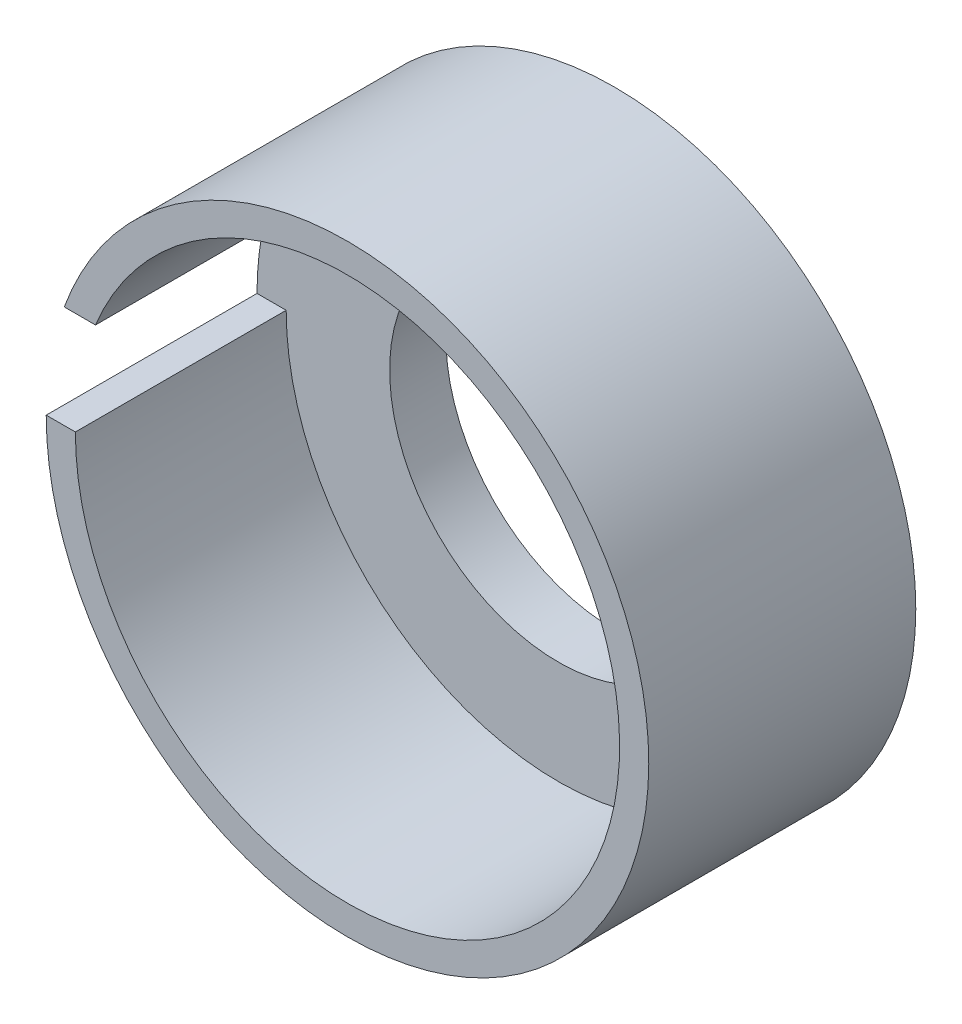
ISO-10303-21;
HEADER;
FILE_DESCRIPTION(('STEP AP214'),'2;1');
FILE_NAME('part.step','',(''),(''),'','','');
FILE_SCHEMA(('AUTOMOTIVE_DESIGN { 1 0 10303 214 1 1 1 1 }'));
ENDSEC;
DATA;
#1=APPLICATION_CONTEXT('core data for automotive mechanical design processes');
#2=APPLICATION_PROTOCOL_DEFINITION('international standard','automotive_design',2000,#1);
#3=PRODUCT_CONTEXT('',#1,'mechanical');
#4=PRODUCT('Part','Part','',(#3));
#5=PRODUCT_RELATED_PRODUCT_CATEGORY('part','',(#4));
#6=PRODUCT_DEFINITION_FORMATION('','',#4);
#7=PRODUCT_DEFINITION_CONTEXT('part definition',#1,'design');
#8=PRODUCT_DEFINITION('design','',#6,#7);
#9=PRODUCT_DEFINITION_SHAPE('','',#8);
#10=(LENGTH_UNIT() NAMED_UNIT(*) SI_UNIT(.MILLI.,.METRE.));
#11=(NAMED_UNIT(*) PLANE_ANGLE_UNIT() SI_UNIT($,.RADIAN.));
#12=(NAMED_UNIT(*) SI_UNIT($,.STERADIAN.) SOLID_ANGLE_UNIT());
#13=UNCERTAINTY_MEASURE_WITH_UNIT(LENGTH_MEASURE(1.E-05),#10,'distance_accuracy_value','');
#14=(GEOMETRIC_REPRESENTATION_CONTEXT(3) GLOBAL_UNCERTAINTY_ASSIGNED_CONTEXT((#13)) GLOBAL_UNIT_ASSIGNED_CONTEXT((#10,
#11,#12)) REPRESENTATION_CONTEXT('',''));
#15=CARTESIAN_POINT('',(0.,0.,0.));
#16=DIRECTION('',(0.,0.,1.));
#17=DIRECTION('',(1.,0.,0.));
#18=AXIS2_PLACEMENT_3D('',#15,#16,#17);
#19=CARTESIAN_POINT('',(0.,0.,8.));
#20=DIRECTION('',(0.,0.,1.));
#21=DIRECTION('',(1.,0.,0.));
#22=AXIS2_PLACEMENT_3D('',#19,#20,#21);
#23=PLANE('',#22);
#24=CARTESIAN_POINT('',(0.,0.,8.));
#25=DIRECTION('',(0.,0.,1.));
#26=DIRECTION('',(1.,0.,0.));
#27=AXIS2_PLACEMENT_3D('',#24,#25,#26);
#28=CIRCLE('',#27,24.);
#29=CARTESIAN_POINT('',(24.,0.,8.));
#30=VERTEX_POINT('',#29);
#31=EDGE_CURVE('E110',#30,#30,#28,.T.);
#32=ORIENTED_EDGE('',*,*,#31,.F.);
#33=EDGE_LOOP('',(#32));
#34=FACE_BOUND('',#33,.T.);
#35=CARTESIAN_POINT('',(0.,0.,8.));
#36=DIRECTION('',(0.,0.,1.));
#37=DIRECTION('',(1.,0.,0.));
#38=AXIS2_PLACEMENT_3D('',#35,#36,#37);
#39=CIRCLE('',#38,38.725);
#40=CARTESIAN_POINT('',(-38.725,0.,8.));
#41=VERTEX_POINT('',#40);
#42=CARTESIAN_POINT('',(-35.860803878207,14.616031274213,8.));
#43=VERTEX_POINT('',#42);
#44=EDGE_CURVE('E59',#41,#43,#39,.T.);
#45=ORIENTED_EDGE('',*,*,#44,.T.);
#46=DIRECTION('',(-1.,0.,0.));
#47=VECTOR('',#46,1.);
#48=CARTESIAN_POINT('',(2.05302480507719E-13,14.6160312742125,8.));
#49=LINE('',#48,#47);
#50=CARTESIAN_POINT('',(-40.3067891898031,14.616031274213,8.));
#51=VERTEX_POINT('',#50);
#52=EDGE_CURVE('E105',#43,#51,#49,.T.);
#53=ORIENTED_EDGE('',*,*,#52,.T.);
#54=CARTESIAN_POINT('',(0.,0.,8.));
#55=DIRECTION('',(0.,0.,1.));
#56=DIRECTION('',(1.,0.,0.));
#57=AXIS2_PLACEMENT_3D('',#54,#55,#56);
#58=CIRCLE('',#57,42.875);
#59=CARTESIAN_POINT('',(-42.875,0.,8.));
#60=VERTEX_POINT('',#59);
#61=EDGE_CURVE('E11',#51,#60,#58,.T.);
#62=ORIENTED_EDGE('',*,*,#61,.T.);
#63=DIRECTION('',(-1.,0.,0.));
#64=VECTOR('',#63,1.);
#65=CARTESIAN_POINT('',(0.,0.,8.));
#66=LINE('',#65,#64);
#67=EDGE_CURVE('E63',#41,#60,#66,.T.);
#68=ORIENTED_EDGE('',*,*,#67,.F.);
#69=EDGE_LOOP('',(#45,#53,#62,#68));
#70=FACE_BOUND('',#69,.T.);
#71=ADVANCED_FACE('F41',(#34,#70),#23,.T.);
#72=CARTESIAN_POINT('',(0.,0.,8.));
#73=DIRECTION('',(0.,0.,-1.));
#74=DIRECTION('',(-1.,0.,0.));
#75=AXIS2_PLACEMENT_3D('',#72,#73,#74);
#76=CYLINDRICAL_SURFACE('',#75,42.875);
#77=ORIENTED_EDGE('',*,*,#61,.F.);
#78=DIRECTION('',(0.,0.,-1.));
#79=VECTOR('',#78,1.);
#80=CARTESIAN_POINT('',(-40.3067891898031,14.616031274213,38.));
#81=LINE('',#80,#79);
#82=CARTESIAN_POINT('',(-40.3067891898031,14.616031274213,38.));
#83=VERTEX_POINT('',#82);
#84=EDGE_CURVE('E123',#83,#51,#81,.T.);
#85=ORIENTED_EDGE('',*,*,#84,.F.);
#86=CARTESIAN_POINT('',(0.,0.,38.));
#87=DIRECTION('',(0.,0.,1.));
#88=DIRECTION('',(1.,0.,0.));
#89=AXIS2_PLACEMENT_3D('',#86,#87,#88);
#90=CIRCLE('',#89,42.875);
#91=CARTESIAN_POINT('',(-42.875,0.,38.));
#92=VERTEX_POINT('',#91);
#93=EDGE_CURVE('E99',#92,#83,#90,.T.);
#94=ORIENTED_EDGE('',*,*,#93,.F.);
#95=DIRECTION('',(0.,0.,-1.));
#96=VECTOR('',#95,1.);
#97=CARTESIAN_POINT('',(-42.875,0.,38.));
#98=LINE('',#97,#96);
#99=EDGE_CURVE('E90',#92,#60,#98,.T.);
#100=ORIENTED_EDGE('',*,*,#99,.T.);
#101=EDGE_LOOP('',(#77,#85,#94,#100));
#102=FACE_BOUND('',#101,.T.);
#103=CARTESIAN_POINT('',(0.,0.,0.));
#104=DIRECTION('',(0.,0.,1.));
#105=DIRECTION('',(1.,0.,0.));
#106=AXIS2_PLACEMENT_3D('',#103,#104,#105);
#107=CIRCLE('',#106,42.875);
#108=CARTESIAN_POINT('',(42.875,0.,0.));
#109=VERTEX_POINT('',#108);
#110=EDGE_CURVE('E51',#109,#109,#107,.T.);
#111=ORIENTED_EDGE('',*,*,#110,.T.);
#112=EDGE_LOOP('',(#111));
#113=FACE_BOUND('',#112,.T.);
#114=ADVANCED_FACE('F43',(#102,#113),#76,.T.);
#115=CARTESIAN_POINT('',(0.,0.,0.));
#116=DIRECTION('',(0.,0.,1.));
#117=DIRECTION('',(1.,0.,0.));
#118=AXIS2_PLACEMENT_3D('',#115,#116,#117);
#119=PLANE('',#118);
#120=CARTESIAN_POINT('',(0.,0.,0.));
#121=DIRECTION('',(0.,0.,1.));
#122=DIRECTION('',(1.,0.,0.));
#123=AXIS2_PLACEMENT_3D('',#120,#121,#122);
#124=CIRCLE('',#123,24.);
#125=CARTESIAN_POINT('',(24.,0.,0.));
#126=VERTEX_POINT('',#125);
#127=EDGE_CURVE('E45',#126,#126,#124,.T.);
#128=ORIENTED_EDGE('',*,*,#127,.T.);
#129=EDGE_LOOP('',(#128));
#130=FACE_BOUND('',#129,.T.);
#131=ORIENTED_EDGE('',*,*,#110,.F.);
#132=EDGE_LOOP('',(#131));
#133=FACE_BOUND('',#132,.T.);
#134=ADVANCED_FACE('F133',(#130,#133),#119,.F.);
#135=CARTESIAN_POINT('',(0.,0.,38.));
#136=DIRECTION('',(0.,0.,-1.));
#137=DIRECTION('',(-1.,0.,0.));
#138=AXIS2_PLACEMENT_3D('',#135,#136,#137);
#139=CYLINDRICAL_SURFACE('',#138,38.725);
#140=ORIENTED_EDGE('',*,*,#44,.F.);
#141=DIRECTION('',(0.,0.,-1.));
#142=VECTOR('',#141,1.);
#143=CARTESIAN_POINT('',(-38.725,0.,38.));
#144=LINE('',#143,#142);
#145=CARTESIAN_POINT('',(-38.725,0.,38.));
#146=VERTEX_POINT('',#145);
#147=EDGE_CURVE('E82',#146,#41,#144,.T.);
#148=ORIENTED_EDGE('',*,*,#147,.F.);
#149=CARTESIAN_POINT('',(0.,0.,38.));
#150=DIRECTION('',(0.,0.,1.));
#151=DIRECTION('',(1.,0.,0.));
#152=AXIS2_PLACEMENT_3D('',#149,#150,#151);
#153=CIRCLE('',#152,38.725);
#154=CARTESIAN_POINT('',(-35.860803878207,14.616031274213,38.));
#155=VERTEX_POINT('',#154);
#156=EDGE_CURVE('E86',#146,#155,#153,.T.);
#157=ORIENTED_EDGE('',*,*,#156,.T.);
#158=DIRECTION('',(0.,0.,-1.));
#159=VECTOR('',#158,1.);
#160=CARTESIAN_POINT('',(-35.860803878207,14.616031274213,38.));
#161=LINE('',#160,#159);
#162=EDGE_CURVE('E116',#155,#43,#161,.T.);
#163=ORIENTED_EDGE('',*,*,#162,.T.);
#164=EDGE_LOOP('',(#140,#148,#157,#163));
#165=FACE_BOUND('',#164,.T.);
#166=ADVANCED_FACE('F84',(#165),#139,.F.);
#167=CARTESIAN_POINT('',(0.,0.,38.));
#168=DIRECTION('',(0.,-1.,0.));
#169=DIRECTION('',(0.,0.,-1.));
#170=AXIS2_PLACEMENT_3D('',#167,#168,#169);
#171=PLANE('',#170);
#172=ORIENTED_EDGE('',*,*,#67,.T.);
#173=ORIENTED_EDGE('',*,*,#99,.F.);
#174=DIRECTION('',(-1.,0.,0.));
#175=VECTOR('',#174,1.);
#176=CARTESIAN_POINT('',(0.,0.,38.));
#177=LINE('',#176,#175);
#178=EDGE_CURVE('E93',#146,#92,#177,.T.);
#179=ORIENTED_EDGE('',*,*,#178,.F.);
#180=ORIENTED_EDGE('',*,*,#147,.T.);
#181=EDGE_LOOP('',(#172,#173,#179,#180));
#182=FACE_BOUND('',#181,.T.);
#183=ADVANCED_FACE('F94',(#182),#171,.F.);
#184=CARTESIAN_POINT('',(2.05302480507719E-13,14.6160312742125,38.));
#185=DIRECTION('',(0.,-1.,0.));
#186=DIRECTION('',(1.,0.,0.));
#187=AXIS2_PLACEMENT_3D('',#184,#185,#186);
#188=PLANE('',#187);
#189=ORIENTED_EDGE('',*,*,#52,.F.);
#190=ORIENTED_EDGE('',*,*,#162,.F.);
#191=DIRECTION('',(-1.,0.,0.));
#192=VECTOR('',#191,1.);
#193=CARTESIAN_POINT('',(2.05302480507719E-13,14.6160312742125,38.));
#194=LINE('',#193,#192);
#195=EDGE_CURVE('E103',#155,#83,#194,.T.);
#196=ORIENTED_EDGE('',*,*,#195,.T.);
#197=ORIENTED_EDGE('',*,*,#84,.T.);
#198=EDGE_LOOP('',(#189,#190,#196,#197));
#199=FACE_BOUND('',#198,.T.);
#200=ADVANCED_FACE('F152',(#199),#188,.T.);
#201=CARTESIAN_POINT('',(0.,0.,38.));
#202=DIRECTION('',(0.,0.,1.));
#203=DIRECTION('',(1.,0.,0.));
#204=AXIS2_PLACEMENT_3D('',#201,#202,#203);
#205=PLANE('',#204);
#206=ORIENTED_EDGE('',*,*,#156,.F.);
#207=ORIENTED_EDGE('',*,*,#178,.T.);
#208=ORIENTED_EDGE('',*,*,#93,.T.);
#209=ORIENTED_EDGE('',*,*,#195,.F.);
#210=EDGE_LOOP('',(#206,#207,#208,#209));
#211=FACE_BOUND('',#210,.T.);
#212=ADVANCED_FACE('F101',(#211),#205,.T.);
#213=CARTESIAN_POINT('',(0.,0.,-12.));
#214=DIRECTION('',(0.,0.,1.));
#215=DIRECTION('',(1.,0.,0.));
#216=AXIS2_PLACEMENT_3D('',#213,#214,#215);
#217=CYLINDRICAL_SURFACE('',#216,24.);
#218=ORIENTED_EDGE('',*,*,#31,.T.);
#219=EDGE_LOOP('',(#218));
#220=FACE_BOUND('',#219,.T.);
#221=ORIENTED_EDGE('',*,*,#127,.F.);
#222=EDGE_LOOP('',(#221));
#223=FACE_BOUND('',#222,.T.);
#224=ADVANCED_FACE('F158',(#220,#223),#217,.F.);
#225=CLOSED_SHELL('',(#71,#114,#134,#166,#183,#200,#212,#224));
#226=MANIFOLD_SOLID_BREP('B2',#225);
#227=ADVANCED_BREP_SHAPE_REPRESENTATION('',(#18,#226),#14);
#228=SHAPE_DEFINITION_REPRESENTATION(#9,#227);
ENDSEC;
END-ISO-10303-21;
